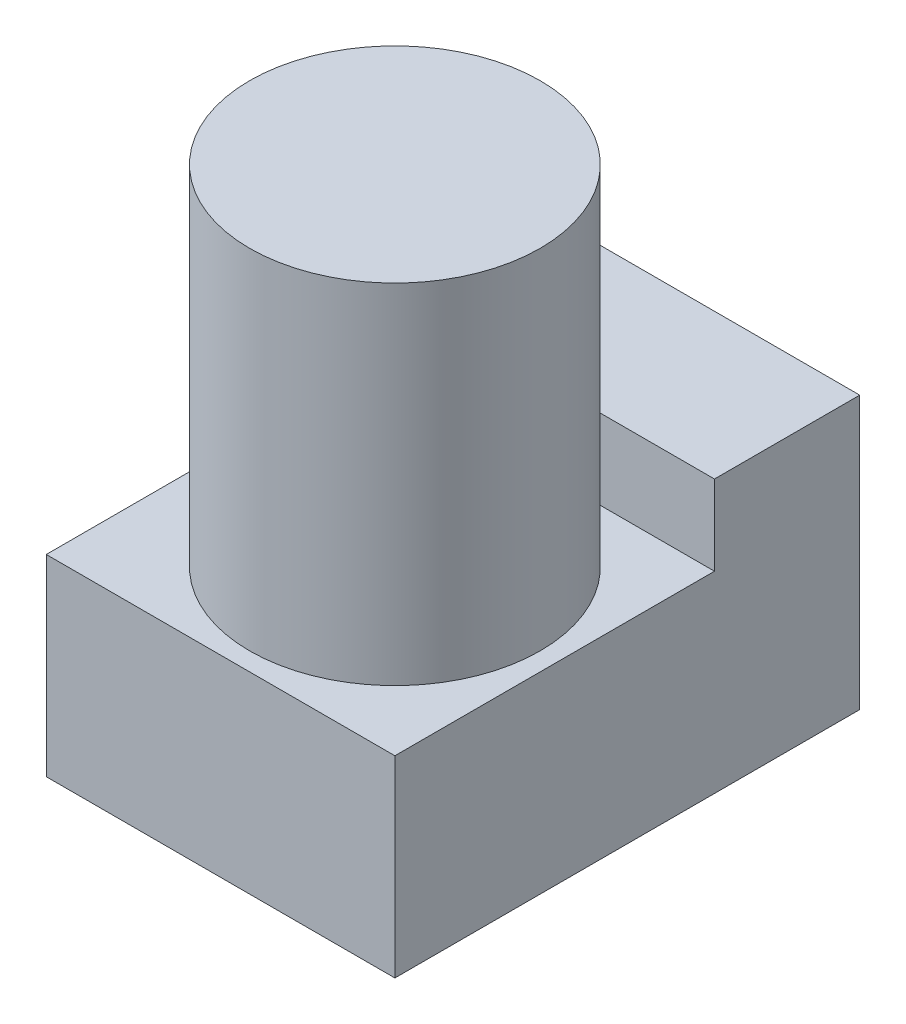
ISO-10303-21;
HEADER;
FILE_DESCRIPTION(('STEP AP214'),'2;1');
FILE_NAME('part.step','',(''),(''),'','','');
FILE_SCHEMA(('AUTOMOTIVE_DESIGN { 1 0 10303 214 1 1 1 1 }'));
ENDSEC;
DATA;
#1=APPLICATION_CONTEXT('core data for automotive mechanical design processes');
#2=APPLICATION_PROTOCOL_DEFINITION('international standard','automotive_design',2000,#1);
#3=PRODUCT_CONTEXT('',#1,'mechanical');
#4=PRODUCT('Part','Part','',(#3));
#5=PRODUCT_RELATED_PRODUCT_CATEGORY('part','',(#4));
#6=PRODUCT_DEFINITION_FORMATION('','',#4);
#7=PRODUCT_DEFINITION_CONTEXT('part definition',#1,'design');
#8=PRODUCT_DEFINITION('design','',#6,#7);
#9=PRODUCT_DEFINITION_SHAPE('','',#8);
#10=(LENGTH_UNIT() NAMED_UNIT(*) SI_UNIT(.MILLI.,.METRE.));
#11=(NAMED_UNIT(*) PLANE_ANGLE_UNIT() SI_UNIT($,.RADIAN.));
#12=(NAMED_UNIT(*) SI_UNIT($,.STERADIAN.) SOLID_ANGLE_UNIT());
#13=UNCERTAINTY_MEASURE_WITH_UNIT(LENGTH_MEASURE(1.E-05),#10,'distance_accuracy_value','');
#14=(GEOMETRIC_REPRESENTATION_CONTEXT(3) GLOBAL_UNCERTAINTY_ASSIGNED_CONTEXT((#13)) GLOBAL_UNIT_ASSIGNED_CONTEXT((#10,
#11,#12)) REPRESENTATION_CONTEXT('',''));
#15=CARTESIAN_POINT('',(0.,0.,0.));
#16=DIRECTION('',(0.,0.,1.));
#17=DIRECTION('',(1.,0.,0.));
#18=AXIS2_PLACEMENT_3D('',#15,#16,#17);
#19=CARTESIAN_POINT('',(96.,-56.4036244363497,101.44929930081));
#20=DIRECTION('',(0.,0.,-1.));
#21=DIRECTION('',(-1.,0.,0.));
#22=AXIS2_PLACEMENT_3D('',#19,#20,#21);
#23=PLANE('',#22);
#24=DIRECTION('',(0.,-1.,0.));
#25=VECTOR('',#24,1.);
#26=CARTESIAN_POINT('',(0.,-56.4036244363497,101.44929930081));
#27=LINE('',#26,#25);
#28=CARTESIAN_POINT('',(0.,-3.40362443634971,101.44929930081));
#29=VERTEX_POINT('',#28);
#30=CARTESIAN_POINT('',(0.,-56.4036244363497,101.44929930081));
#31=VERTEX_POINT('',#30);
#32=EDGE_CURVE('E124',#29,#31,#27,.T.);
#33=ORIENTED_EDGE('',*,*,#32,.T.);
#34=DIRECTION('',(-1.,0.,0.));
#35=VECTOR('',#34,1.);
#36=CARTESIAN_POINT('',(96.,-56.4036244363497,101.44929930081));
#37=LINE('',#36,#35);
#38=CARTESIAN_POINT('',(96.,-56.4036244363497,101.44929930081));
#39=VERTEX_POINT('',#38);
#40=EDGE_CURVE('E47',#39,#31,#37,.T.);
#41=ORIENTED_EDGE('',*,*,#40,.F.);
#42=DIRECTION('',(0.,-1.,0.));
#43=VECTOR('',#42,1.);
#44=CARTESIAN_POINT('',(96.,-56.4036244363497,101.44929930081));
#45=LINE('',#44,#43);
#46=CARTESIAN_POINT('',(96.,-3.40362443634971,101.44929930081));
#47=VERTEX_POINT('',#46);
#48=EDGE_CURVE('E136',#47,#39,#45,.T.);
#49=ORIENTED_EDGE('',*,*,#48,.F.);
#50=DIRECTION('',(-1.,0.,0.));
#51=VECTOR('',#50,1.);
#52=CARTESIAN_POINT('',(96.,-3.40362443634971,101.44929930081));
#53=LINE('',#52,#51);
#54=EDGE_CURVE('E120',#47,#29,#53,.T.);
#55=ORIENTED_EDGE('',*,*,#54,.T.);
#56=EDGE_LOOP('',(#33,#41,#49,#55));
#57=FACE_BOUND('',#56,.T.);
#58=ADVANCED_FACE('F39',(#57),#23,.F.);
#59=CARTESIAN_POINT('',(96.,-56.4036244363497,101.44929930081));
#60=DIRECTION('',(0.,1.,0.));
#61=DIRECTION('',(0.,0.,1.));
#62=AXIS2_PLACEMENT_3D('',#59,#60,#61);
#63=PLANE('',#62);
#64=DIRECTION('',(0.,0.,-1.));
#65=VECTOR('',#64,1.);
#66=CARTESIAN_POINT('',(0.,-56.4036244363497,101.44929930081));
#67=LINE('',#66,#65);
#68=CARTESIAN_POINT('',(0.,-56.4036244363497,-26.5507006991898));
#69=VERTEX_POINT('',#68);
#70=EDGE_CURVE('E127',#31,#69,#67,.T.);
#71=ORIENTED_EDGE('',*,*,#70,.T.);
#72=DIRECTION('',(-1.,0.,0.));
#73=VECTOR('',#72,1.);
#74=CARTESIAN_POINT('',(96.,-56.4036244363497,-26.5507006991898));
#75=LINE('',#74,#73);
#76=CARTESIAN_POINT('',(96.,-56.4036244363497,-26.5507006991898));
#77=VERTEX_POINT('',#76);
#78=EDGE_CURVE('E140',#77,#69,#75,.T.);
#79=ORIENTED_EDGE('',*,*,#78,.F.);
#80=DIRECTION('',(0.,0.,-1.));
#81=VECTOR('',#80,1.);
#82=CARTESIAN_POINT('',(96.,-56.4036244363497,101.44929930081));
#83=LINE('',#82,#81);
#84=EDGE_CURVE('E93',#39,#77,#83,.T.);
#85=ORIENTED_EDGE('',*,*,#84,.F.);
#86=ORIENTED_EDGE('',*,*,#40,.T.);
#87=EDGE_LOOP('',(#71,#79,#85,#86));
#88=FACE_BOUND('',#87,.T.);
#89=ADVANCED_FACE('F143',(#88),#63,.F.);
#90=CARTESIAN_POINT('',(96.,-3.40362443634971,-26.5507006991898));
#91=DIRECTION('',(0.,0.,1.));
#92=DIRECTION('',(0.,-1.,0.));
#93=AXIS2_PLACEMENT_3D('',#90,#91,#92);
#94=PLANE('',#93);
#95=DIRECTION('',(0.,1.,0.));
#96=VECTOR('',#95,1.);
#97=CARTESIAN_POINT('',(0.,-3.40362443634971,-26.5507006991898));
#98=LINE('',#97,#96);
#99=CARTESIAN_POINT('',(0.,18.5963755636503,-26.5507006991898));
#100=VERTEX_POINT('',#99);
#101=EDGE_CURVE('E131',#69,#100,#98,.T.);
#102=ORIENTED_EDGE('',*,*,#101,.T.);
#103=DIRECTION('',(-1.,0.,0.));
#104=VECTOR('',#103,1.);
#105=CARTESIAN_POINT('',(96.,18.5963755636503,-26.5507006991898));
#106=LINE('',#105,#104);
#107=CARTESIAN_POINT('',(96.,18.5963755636503,-26.5507006991898));
#108=VERTEX_POINT('',#107);
#109=EDGE_CURVE('E115',#108,#100,#106,.T.);
#110=ORIENTED_EDGE('',*,*,#109,.F.);
#111=DIRECTION('',(0.,1.,0.));
#112=VECTOR('',#111,1.);
#113=CARTESIAN_POINT('',(96.,-56.4036244363497,-26.5507006991898));
#114=LINE('',#113,#112);
#115=EDGE_CURVE('E106',#77,#108,#114,.T.);
#116=ORIENTED_EDGE('',*,*,#115,.F.);
#117=ORIENTED_EDGE('',*,*,#78,.T.);
#118=EDGE_LOOP('',(#102,#110,#116,#117));
#119=FACE_BOUND('',#118,.T.);
#120=ADVANCED_FACE('F150',(#119),#94,.F.);
#121=CARTESIAN_POINT('',(96.,18.5963755636503,-26.5507006991898));
#122=DIRECTION('',(0.,-1.,0.));
#123=DIRECTION('',(0.,0.,-1.));
#124=AXIS2_PLACEMENT_3D('',#121,#122,#123);
#125=PLANE('',#124);
#126=DIRECTION('',(0.,0.,1.));
#127=VECTOR('',#126,1.);
#128=CARTESIAN_POINT('',(0.,18.5963755636503,-26.5507006991898));
#129=LINE('',#128,#127);
#130=CARTESIAN_POINT('',(0.,18.5963755636503,13.4492993008102));
#131=VERTEX_POINT('',#130);
#132=EDGE_CURVE('E114',#100,#131,#129,.T.);
#133=ORIENTED_EDGE('',*,*,#132,.T.);
#134=DIRECTION('',(-1.,0.,0.));
#135=VECTOR('',#134,1.);
#136=CARTESIAN_POINT('',(96.,18.5963755636503,13.4492993008102));
#137=LINE('',#136,#135);
#138=CARTESIAN_POINT('',(96.,18.5963755636503,13.4492993008102));
#139=VERTEX_POINT('',#138);
#140=EDGE_CURVE('E111',#139,#131,#137,.T.);
#141=ORIENTED_EDGE('',*,*,#140,.F.);
#142=DIRECTION('',(0.,0.,1.));
#143=VECTOR('',#142,1.);
#144=CARTESIAN_POINT('',(96.,18.5963755636503,-26.5507006991898));
#145=LINE('',#144,#143);
#146=EDGE_CURVE('E100',#108,#139,#145,.T.);
#147=ORIENTED_EDGE('',*,*,#146,.F.);
#148=ORIENTED_EDGE('',*,*,#109,.T.);
#149=EDGE_LOOP('',(#133,#141,#147,#148));
#150=FACE_BOUND('',#149,.T.);
#151=ADVANCED_FACE('F112',(#150),#125,.F.);
#152=CARTESIAN_POINT('',(96.,-3.40362443634976,13.4492993008102));
#153=DIRECTION('',(0.,0.,-1.));
#154=DIRECTION('',(0.,1.,0.));
#155=AXIS2_PLACEMENT_3D('',#152,#153,#154);
#156=PLANE('',#155);
#157=DIRECTION('',(0.,-1.,0.));
#158=VECTOR('',#157,1.);
#159=CARTESIAN_POINT('',(0.,-3.40362443634976,13.4492993008102));
#160=LINE('',#159,#158);
#161=CARTESIAN_POINT('',(0.,-3.40362443634976,13.4492993008102));
#162=VERTEX_POINT('',#161);
#163=EDGE_CURVE('E78',#131,#162,#160,.T.);
#164=ORIENTED_EDGE('',*,*,#163,.T.);
#165=DIRECTION('',(-1.,0.,0.));
#166=VECTOR('',#165,1.);
#167=CARTESIAN_POINT('',(96.,-3.40362443634976,13.4492993008102));
#168=LINE('',#167,#166);
#169=CARTESIAN_POINT('',(96.,-3.40362443634976,13.4492993008102));
#170=VERTEX_POINT('',#169);
#171=EDGE_CURVE('E116',#170,#162,#168,.T.);
#172=ORIENTED_EDGE('',*,*,#171,.F.);
#173=DIRECTION('',(0.,-1.,0.));
#174=VECTOR('',#173,1.);
#175=CARTESIAN_POINT('',(96.,-3.40362443634976,13.4492993008102));
#176=LINE('',#175,#174);
#177=EDGE_CURVE('E104',#139,#170,#176,.T.);
#178=ORIENTED_EDGE('',*,*,#177,.F.);
#179=ORIENTED_EDGE('',*,*,#140,.T.);
#180=EDGE_LOOP('',(#164,#172,#178,#179));
#181=FACE_BOUND('',#180,.T.);
#182=ADVANCED_FACE('F118',(#181),#156,.F.);
#183=CARTESIAN_POINT('',(96.,-3.40362443634971,101.44929930081));
#184=DIRECTION('',(0.,-1.,0.));
#185=DIRECTION('',(0.,0.,-1.));
#186=AXIS2_PLACEMENT_3D('',#183,#184,#185);
#187=PLANE('',#186);
#188=CARTESIAN_POINT('',(51.,-3.40362443634973,56.4492993008102));
#189=DIRECTION('',(0.,-1.,0.));
#190=DIRECTION('',(0.,0.,-1.));
#191=AXIS2_PLACEMENT_3D('',#188,#189,#190);
#192=CIRCLE('',#191,40.);
#193=CARTESIAN_POINT('',(51.,-3.40362443634975,16.4492993008102));
#194=VERTEX_POINT('',#193);
#195=EDGE_CURVE('E11',#194,#194,#192,.F.);
#196=ORIENTED_EDGE('',*,*,#195,.F.);
#197=EDGE_LOOP('',(#196));
#198=FACE_BOUND('',#197,.T.);
#199=DIRECTION('',(0.,0.,1.));
#200=VECTOR('',#199,1.);
#201=CARTESIAN_POINT('',(0.,-3.40362443634971,101.44929930081));
#202=LINE('',#201,#200);
#203=EDGE_CURVE('E84',#162,#29,#202,.T.);
#204=ORIENTED_EDGE('',*,*,#203,.T.);
#205=ORIENTED_EDGE('',*,*,#54,.F.);
#206=DIRECTION('',(0.,0.,1.));
#207=VECTOR('',#206,1.);
#208=CARTESIAN_POINT('',(96.,-3.40362443634971,101.44929930081));
#209=LINE('',#208,#207);
#210=EDGE_CURVE('E55',#170,#47,#209,.T.);
#211=ORIENTED_EDGE('',*,*,#210,.F.);
#212=ORIENTED_EDGE('',*,*,#171,.T.);
#213=EDGE_LOOP('',(#204,#205,#211,#212));
#214=FACE_BOUND('',#213,.T.);
#215=ADVANCED_FACE('F165',(#198,#214),#187,.F.);
#216=CARTESIAN_POINT('',(96.,0.,0.));
#217=DIRECTION('',(-1.,0.,0.));
#218=DIRECTION('',(0.,0.,1.));
#219=AXIS2_PLACEMENT_3D('',#216,#217,#218);
#220=PLANE('',#219);
#221=ORIENTED_EDGE('',*,*,#48,.T.);
#222=ORIENTED_EDGE('',*,*,#84,.T.);
#223=ORIENTED_EDGE('',*,*,#115,.T.);
#224=ORIENTED_EDGE('',*,*,#146,.T.);
#225=ORIENTED_EDGE('',*,*,#177,.T.);
#226=ORIENTED_EDGE('',*,*,#210,.T.);
#227=EDGE_LOOP('',(#221,#222,#223,#224,#225,#226));
#228=FACE_BOUND('',#227,.T.);
#229=ADVANCED_FACE('F102',(#228),#220,.F.);
#230=CARTESIAN_POINT('',(0.,0.,0.));
#231=DIRECTION('',(-1.,0.,0.));
#232=DIRECTION('',(0.,0.,1.));
#233=AXIS2_PLACEMENT_3D('',#230,#231,#232);
#234=PLANE('',#233);
#235=ORIENTED_EDGE('',*,*,#32,.F.);
#236=ORIENTED_EDGE('',*,*,#203,.F.);
#237=ORIENTED_EDGE('',*,*,#163,.F.);
#238=ORIENTED_EDGE('',*,*,#132,.F.);
#239=ORIENTED_EDGE('',*,*,#101,.F.);
#240=ORIENTED_EDGE('',*,*,#70,.F.);
#241=EDGE_LOOP('',(#235,#236,#237,#238,#239,#240));
#242=FACE_BOUND('',#241,.T.);
#243=ADVANCED_FACE('F148',(#242),#234,.T.);
#244=CARTESIAN_POINT('',(51.,92.5963755636502,56.4492993008102));
#245=DIRECTION('',(0.,-1.,0.));
#246=DIRECTION('',(0.,0.,-1.));
#247=AXIS2_PLACEMENT_3D('',#244,#245,#246);
#248=CYLINDRICAL_SURFACE('',#247,40.);
#249=CARTESIAN_POINT('',(51.,92.5963755636502,56.4492993008102));
#250=DIRECTION('',(0.,1.,0.));
#251=DIRECTION('',(0.,0.,1.));
#252=AXIS2_PLACEMENT_3D('',#249,#250,#251);
#253=CIRCLE('',#252,40.);
#254=CARTESIAN_POINT('',(51.,92.5963755636502,96.4492993008102));
#255=VERTEX_POINT('',#254);
#256=EDGE_CURVE('E128',#255,#255,#253,.T.);
#257=ORIENTED_EDGE('',*,*,#256,.F.);
#258=EDGE_LOOP('',(#257));
#259=FACE_BOUND('',#258,.T.);
#260=ORIENTED_EDGE('',*,*,#195,.T.);
#261=EDGE_LOOP('',(#260));
#262=FACE_BOUND('',#261,.T.);
#263=ADVANCED_FACE('F159',(#259,#262),#248,.T.);
#264=CARTESIAN_POINT('',(51.,92.5963755636502,56.4492993008102));
#265=DIRECTION('',(0.,1.,0.));
#266=DIRECTION('',(0.,0.,1.));
#267=AXIS2_PLACEMENT_3D('',#264,#265,#266);
#268=PLANE('',#267);
#269=ORIENTED_EDGE('',*,*,#256,.T.);
#270=EDGE_LOOP('',(#269));
#271=FACE_BOUND('',#270,.T.);
#272=ADVANCED_FACE('F157',(#271),#268,.T.);
#273=CLOSED_SHELL('',(#58,#89,#120,#151,#182,#215,#229,#243,#263,#272));
#274=MANIFOLD_SOLID_BREP('B2',#273);
#275=ADVANCED_BREP_SHAPE_REPRESENTATION('',(#18,#274),#14);
#276=SHAPE_DEFINITION_REPRESENTATION(#9,#275);
ENDSEC;
END-ISO-10303-21;
